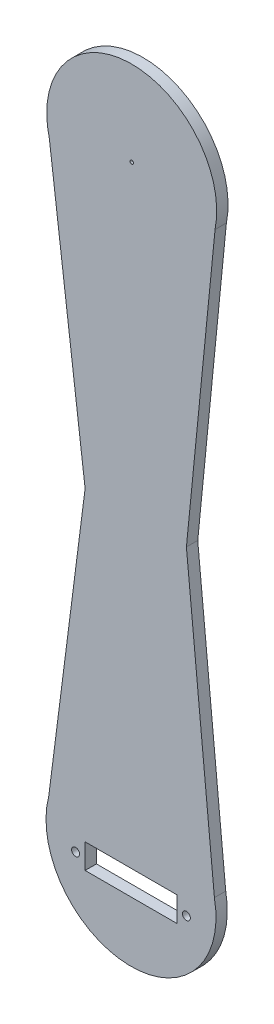
ISO-10303-21;
HEADER;
FILE_DESCRIPTION(('STEP AP214'),'2;1');
FILE_NAME('part.step','',(''),(''),'','','');
FILE_SCHEMA(('AUTOMOTIVE_DESIGN { 1 0 10303 214 1 1 1 1 }'));
ENDSEC;
DATA;
#1=APPLICATION_CONTEXT('core data for automotive mechanical design processes');
#2=APPLICATION_PROTOCOL_DEFINITION('international standard','automotive_design',2000,#1);
#3=PRODUCT_CONTEXT('',#1,'mechanical');
#4=PRODUCT('Part','Part','',(#3));
#5=PRODUCT_RELATED_PRODUCT_CATEGORY('part','',(#4));
#6=PRODUCT_DEFINITION_FORMATION('','',#4);
#7=PRODUCT_DEFINITION_CONTEXT('part definition',#1,'design');
#8=PRODUCT_DEFINITION('design','',#6,#7);
#9=PRODUCT_DEFINITION_SHAPE('','',#8);
#10=(LENGTH_UNIT() NAMED_UNIT(*) SI_UNIT(.MILLI.,.METRE.));
#11=(NAMED_UNIT(*) PLANE_ANGLE_UNIT() SI_UNIT($,.RADIAN.));
#12=(NAMED_UNIT(*) SI_UNIT($,.STERADIAN.) SOLID_ANGLE_UNIT());
#13=UNCERTAINTY_MEASURE_WITH_UNIT(LENGTH_MEASURE(1.E-05),#10,'distance_accuracy_value','');
#14=(GEOMETRIC_REPRESENTATION_CONTEXT(3) GLOBAL_UNCERTAINTY_ASSIGNED_CONTEXT((#13)) GLOBAL_UNIT_ASSIGNED_CONTEXT((#10,
#11,#12)) REPRESENTATION_CONTEXT('',''));
#15=CARTESIAN_POINT('',(0.,0.,0.));
#16=DIRECTION('',(0.,0.,1.));
#17=DIRECTION('',(1.,0.,0.));
#18=AXIS2_PLACEMENT_3D('',#15,#16,#17);
#19=CARTESIAN_POINT('',(0.323183532153549,270.,0.));
#20=DIRECTION('',(0.,0.,1.));
#21=DIRECTION('',(1.,0.,0.));
#22=AXIS2_PLACEMENT_3D('',#19,#20,#21);
#23=CYLINDRICAL_SURFACE('',#22,2.6);
#24=CARTESIAN_POINT('',(0.323183532153549,270.,0.));
#25=DIRECTION('',(0.,0.,1.));
#26=DIRECTION('',(1.,0.,0.));
#27=AXIS2_PLACEMENT_3D('',#24,#25,#26);
#28=CIRCLE('',#27,2.6);
#29=CARTESIAN_POINT('',(2.92318353215355,270.,0.));
#30=VERTEX_POINT('',#29);
#31=EDGE_CURVE('E365',#30,#30,#28,.T.);
#32=ORIENTED_EDGE('',*,*,#31,.F.);
#33=EDGE_LOOP('',(#32));
#34=FACE_BOUND('',#33,.T.);
#35=CARTESIAN_POINT('',(0.323183532153549,270.,4.));
#36=DIRECTION('',(0.,0.,1.));
#37=DIRECTION('',(1.,0.,0.));
#38=AXIS2_PLACEMENT_3D('',#35,#36,#37);
#39=CIRCLE('',#38,2.6);
#40=CARTESIAN_POINT('',(2.92318353215355,270.,4.));
#41=VERTEX_POINT('',#40);
#42=EDGE_CURVE('E12',#41,#41,#39,.F.);
#43=ORIENTED_EDGE('',*,*,#42,.F.);
#44=EDGE_LOOP('',(#43));
#45=FACE_BOUND('',#44,.T.);
#46=ADVANCED_FACE('F221',(#34,#45),#23,.F.);
#47=CARTESIAN_POINT('',(-37.5,0.,5.));
#48=DIRECTION('',(0.,1.,0.));
#49=DIRECTION('',(0.,0.,1.));
#50=AXIS2_PLACEMENT_3D('',#47,#48,#49);
#51=PLANE('',#50);
#52=DIRECTION('',(1.,0.,0.));
#53=VECTOR('',#52,1.);
#54=CARTESIAN_POINT('',(-37.5,0.,0.));
#55=LINE('',#54,#53);
#56=CARTESIAN_POINT('',(-20.25,0.,0.));
#57=VERTEX_POINT('',#56);
#58=CARTESIAN_POINT('',(20.25,0.,0.));
#59=VERTEX_POINT('',#58);
#60=EDGE_CURVE('E348',#57,#59,#55,.T.);
#61=ORIENTED_EDGE('',*,*,#60,.T.);
#62=DIRECTION('',(0.,0.,1.));
#63=VECTOR('',#62,1.);
#64=CARTESIAN_POINT('',(20.25,0.,5.));
#65=LINE('',#64,#63);
#66=CARTESIAN_POINT('',(20.25,0.,5.));
#67=VERTEX_POINT('',#66);
#68=EDGE_CURVE('E275',#59,#67,#65,.T.);
#69=ORIENTED_EDGE('',*,*,#68,.T.);
#70=DIRECTION('',(1.,0.,0.));
#71=VECTOR('',#70,1.);
#72=CARTESIAN_POINT('',(-37.5,0.,5.));
#73=LINE('',#72,#71);
#74=CARTESIAN_POINT('',(-20.25,0.,5.));
#75=VERTEX_POINT('',#74);
#76=EDGE_CURVE('E375',#75,#67,#73,.T.);
#77=ORIENTED_EDGE('',*,*,#76,.F.);
#78=DIRECTION('',(0.,0.,1.));
#79=VECTOR('',#78,1.);
#80=CARTESIAN_POINT('',(-20.25,0.,5.));
#81=LINE('',#80,#79);
#82=EDGE_CURVE('E297',#57,#75,#81,.T.);
#83=ORIENTED_EDGE('',*,*,#82,.F.);
#84=EDGE_LOOP('',(#61,#69,#77,#83));
#85=FACE_BOUND('',#84,.T.);
#86=ADVANCED_FACE('F414',(#85),#51,.F.);
#87=CARTESIAN_POINT('',(0.,0.,0.));
#88=DIRECTION('',(0.,0.,1.));
#89=DIRECTION('',(1.,0.,0.));
#90=AXIS2_PLACEMENT_3D('',#87,#88,#89);
#91=PLANE('',#90);
#92=ORIENTED_EDGE('',*,*,#31,.T.);
#93=EDGE_LOOP('',(#92));
#94=FACE_BOUND('',#93,.T.);
#95=DIRECTION('',(0.124409710318504,-0.992230932786549,0.));
#96=VECTOR('',#95,1.);
#97=CARTESIAN_POINT('',(-37.1768164678465,270.,0.));
#98=LINE('',#97,#96);
#99=CARTESIAN_POINT('',(-36.0159832662314,260.741762781223,0.));
#100=VERTEX_POINT('',#99);
#101=CARTESIAN_POINT('',(-20.25,135.,0.));
#102=VERTEX_POINT('',#101);
#103=EDGE_CURVE('E336',#100,#102,#98,.T.);
#104=ORIENTED_EDGE('',*,*,#103,.F.);
#105=CARTESIAN_POINT('',(0.323183532153548,270.,0.));
#106=DIRECTION('',(0.,0.,1.));
#107=DIRECTION('',(1.,0.,0.));
#108=AXIS2_PLACEMENT_3D('',#105,#106,#107);
#109=CIRCLE('',#108,37.5);
#110=CARTESIAN_POINT('',(37.094360017677,262.642651301556,0.));
#111=VERTEX_POINT('',#110);
#112=EDGE_CURVE('E294',#111,#100,#109,.T.);
#113=ORIENTED_EDGE('',*,*,#112,.F.);
#114=DIRECTION('',(0.0985781256653195,0.995129314782914,0.));
#115=VECTOR('',#114,1.);
#116=CARTESIAN_POINT('',(24.45,135.,0.));
#117=LINE('',#116,#115);
#118=CARTESIAN_POINT('',(24.45,135.,0.));
#119=VERTEX_POINT('',#118);
#120=EDGE_CURVE('E329',#119,#111,#117,.T.);
#121=ORIENTED_EDGE('',*,*,#120,.F.);
#122=DIRECTION('',(-0.0962181593708295,0.995360269353408,0.));
#123=VECTOR('',#122,1.);
#124=CARTESIAN_POINT('',(37.5,0.,0.));
#125=LINE('',#124,#123);
#126=CARTESIAN_POINT('',(36.8056549355467,7.1828799771028,0.));
#127=VERTEX_POINT('',#126);
#128=EDGE_CURVE('E350',#127,#119,#125,.T.);
#129=ORIENTED_EDGE('',*,*,#128,.F.);
#130=CARTESIAN_POINT('',(0.,0.,0.));
#131=DIRECTION('',(0.,0.,1.));
#132=DIRECTION('',(1.,0.,0.));
#133=AXIS2_PLACEMENT_3D('',#130,#131,#132);
#134=CIRCLE('',#133,37.5);
#135=CARTESIAN_POINT('',(-36.2951349873971,9.42937835950072,0.));
#136=VERTEX_POINT('',#135);
#137=EDGE_CURVE('E291',#136,#127,#134,.T.);
#138=ORIENTED_EDGE('',*,*,#137,.F.);
#139=DIRECTION('',(-0.126747255728497,-0.991935044831714,0.));
#140=VECTOR('',#139,1.);
#141=CARTESIAN_POINT('',(-20.25,135.,0.));
#142=LINE('',#141,#140);
#143=EDGE_CURVE('E339',#102,#136,#142,.T.);
#144=ORIENTED_EDGE('',*,*,#143,.F.);
#145=EDGE_LOOP('',(#104,#113,#121,#129,#138,#144));
#146=FACE_BOUND('',#145,.T.);
#147=ORIENTED_EDGE('',*,*,#60,.F.);
#148=DIRECTION('',(0.,1.,0.));
#149=VECTOR('',#148,1.);
#150=CARTESIAN_POINT('',(-20.25,-10.95,0.));
#151=LINE('',#150,#149);
#152=CARTESIAN_POINT('',(-20.25,-10.95,0.));
#153=VERTEX_POINT('',#152);
#154=EDGE_CURVE('E284',#153,#57,#151,.T.);
#155=ORIENTED_EDGE('',*,*,#154,.F.);
#156=DIRECTION('',(-1.,0.,0.));
#157=VECTOR('',#156,1.);
#158=CARTESIAN_POINT('',(20.25,-10.95,0.));
#159=LINE('',#158,#157);
#160=CARTESIAN_POINT('',(20.25,-10.95,0.));
#161=VERTEX_POINT('',#160);
#162=EDGE_CURVE('E260',#161,#153,#159,.T.);
#163=ORIENTED_EDGE('',*,*,#162,.F.);
#164=DIRECTION('',(0.,1.,0.));
#165=VECTOR('',#164,1.);
#166=CARTESIAN_POINT('',(20.25,-10.95,0.));
#167=LINE('',#166,#165);
#168=EDGE_CURVE('E272',#161,#59,#167,.T.);
#169=ORIENTED_EDGE('',*,*,#168,.T.);
#170=EDGE_LOOP('',(#147,#155,#163,#169));
#171=FACE_BOUND('',#170,.T.);
#172=CARTESIAN_POINT('',(-24.45,-5.95000000000001,0.));
#173=DIRECTION('',(0.,0.,1.));
#174=DIRECTION('',(1.,0.,0.));
#175=AXIS2_PLACEMENT_3D('',#172,#173,#174);
#176=CIRCLE('',#175,1.75);
#177=CARTESIAN_POINT('',(-22.7,-5.95000000000001,0.));
#178=VERTEX_POINT('',#177);
#179=EDGE_CURVE('E362',#178,#178,#176,.T.);
#180=ORIENTED_EDGE('',*,*,#179,.T.);
#181=EDGE_LOOP('',(#180));
#182=FACE_BOUND('',#181,.T.);
#183=CARTESIAN_POINT('',(24.45,-5.95,0.));
#184=DIRECTION('',(0.,0.,1.));
#185=DIRECTION('',(1.,0.,0.));
#186=AXIS2_PLACEMENT_3D('',#183,#184,#185);
#187=CIRCLE('',#186,1.75);
#188=CARTESIAN_POINT('',(26.2,-5.95,0.));
#189=VERTEX_POINT('',#188);
#190=EDGE_CURVE('E361',#189,#189,#187,.T.);
#191=ORIENTED_EDGE('',*,*,#190,.T.);
#192=EDGE_LOOP('',(#191));
#193=FACE_BOUND('',#192,.T.);
#194=ADVANCED_FACE('F281',(#94,#146,#171,#182,#193),#91,.F.);
#195=CARTESIAN_POINT('',(0.,0.,5.));
#196=DIRECTION('',(0.,0.,1.));
#197=DIRECTION('',(1.,0.,0.));
#198=AXIS2_PLACEMENT_3D('',#195,#196,#197);
#199=PLANE('',#198);
#200=CARTESIAN_POINT('',(0.323183532153549,270.,5.));
#201=DIRECTION('',(0.,0.,-1.));
#202=DIRECTION('',(-1.,0.,0.));
#203=AXIS2_PLACEMENT_3D('',#200,#201,#202);
#204=CIRCLE('',#203,0.750000000000243);
#205=CARTESIAN_POINT('',(-0.426816467846694,270.,5.));
#206=VERTEX_POINT('',#205);
#207=EDGE_CURVE('E392',#206,#206,#204,.T.);
#208=ORIENTED_EDGE('',*,*,#207,.T.);
#209=EDGE_LOOP('',(#208));
#210=FACE_BOUND('',#209,.T.);
#211=CARTESIAN_POINT('',(0.323183532153548,270.,5.));
#212=DIRECTION('',(0.,0.,1.));
#213=DIRECTION('',(1.,0.,0.));
#214=AXIS2_PLACEMENT_3D('',#211,#212,#213);
#215=CIRCLE('',#214,37.5);
#216=CARTESIAN_POINT('',(37.094360017677,262.642651301556,5.));
#217=VERTEX_POINT('',#216);
#218=CARTESIAN_POINT('',(-36.0159832662314,260.741762781223,5.));
#219=VERTEX_POINT('',#218);
#220=EDGE_CURVE('E320',#217,#219,#215,.T.);
#221=ORIENTED_EDGE('',*,*,#220,.T.);
#222=DIRECTION('',(0.124409710318504,-0.992230932786549,0.));
#223=VECTOR('',#222,1.);
#224=CARTESIAN_POINT('',(-37.1768164678465,270.,5.));
#225=LINE('',#224,#223);
#226=CARTESIAN_POINT('',(-20.25,135.,5.));
#227=VERTEX_POINT('',#226);
#228=EDGE_CURVE('E384',#219,#227,#225,.T.);
#229=ORIENTED_EDGE('',*,*,#228,.T.);
#230=DIRECTION('',(-0.126747255728497,-0.991935044831714,0.));
#231=VECTOR('',#230,1.);
#232=CARTESIAN_POINT('',(-20.25,135.,5.));
#233=LINE('',#232,#231);
#234=CARTESIAN_POINT('',(-36.2951349873971,9.42937835950072,5.));
#235=VERTEX_POINT('',#234);
#236=EDGE_CURVE('E381',#227,#235,#233,.T.);
#237=ORIENTED_EDGE('',*,*,#236,.T.);
#238=CARTESIAN_POINT('',(0.,0.,5.));
#239=DIRECTION('',(0.,0.,1.));
#240=DIRECTION('',(1.,0.,0.));
#241=AXIS2_PLACEMENT_3D('',#238,#239,#240);
#242=CIRCLE('',#241,37.5);
#243=CARTESIAN_POINT('',(36.8056549355467,7.1828799771028,5.));
#244=VERTEX_POINT('',#243);
#245=EDGE_CURVE('E292',#235,#244,#242,.T.);
#246=ORIENTED_EDGE('',*,*,#245,.T.);
#247=DIRECTION('',(-0.0962181593708295,0.995360269353408,0.));
#248=VECTOR('',#247,1.);
#249=CARTESIAN_POINT('',(37.5,0.,5.));
#250=LINE('',#249,#248);
#251=CARTESIAN_POINT('',(24.45,135.,5.));
#252=VERTEX_POINT('',#251);
#253=EDGE_CURVE('E343',#244,#252,#250,.T.);
#254=ORIENTED_EDGE('',*,*,#253,.T.);
#255=DIRECTION('',(0.0985781256653195,0.995129314782914,0.));
#256=VECTOR('',#255,1.);
#257=CARTESIAN_POINT('',(24.45,135.,5.));
#258=LINE('',#257,#256);
#259=EDGE_CURVE('E353',#252,#217,#258,.T.);
#260=ORIENTED_EDGE('',*,*,#259,.T.);
#261=EDGE_LOOP('',(#221,#229,#237,#246,#254,#260));
#262=FACE_BOUND('',#261,.T.);
#263=ORIENTED_EDGE('',*,*,#76,.T.);
#264=DIRECTION('',(0.,1.,0.));
#265=VECTOR('',#264,1.);
#266=CARTESIAN_POINT('',(20.25,-10.95,5.));
#267=LINE('',#266,#265);
#268=CARTESIAN_POINT('',(20.25,-10.95,5.));
#269=VERTEX_POINT('',#268);
#270=EDGE_CURVE('E268',#269,#67,#267,.T.);
#271=ORIENTED_EDGE('',*,*,#270,.F.);
#272=DIRECTION('',(-1.,0.,0.));
#273=VECTOR('',#272,1.);
#274=CARTESIAN_POINT('',(20.25,-10.95,5.));
#275=LINE('',#274,#273);
#276=CARTESIAN_POINT('',(-20.25,-10.95,5.));
#277=VERTEX_POINT('',#276);
#278=EDGE_CURVE('E263',#269,#277,#275,.T.);
#279=ORIENTED_EDGE('',*,*,#278,.T.);
#280=DIRECTION('',(0.,1.,0.));
#281=VECTOR('',#280,1.);
#282=CARTESIAN_POINT('',(-20.25,-10.95,5.));
#283=LINE('',#282,#281);
#284=EDGE_CURVE('E279',#277,#75,#283,.T.);
#285=ORIENTED_EDGE('',*,*,#284,.T.);
#286=EDGE_LOOP('',(#263,#271,#279,#285));
#287=FACE_BOUND('',#286,.T.);
#288=CARTESIAN_POINT('',(-24.45,-5.95000000000001,5.));
#289=DIRECTION('',(0.,0.,1.));
#290=DIRECTION('',(1.,0.,0.));
#291=AXIS2_PLACEMENT_3D('',#288,#289,#290);
#292=CIRCLE('',#291,1.75);
#293=CARTESIAN_POINT('',(-22.7,-5.95000000000001,5.));
#294=VERTEX_POINT('',#293);
#295=EDGE_CURVE('E358',#294,#294,#292,.T.);
#296=ORIENTED_EDGE('',*,*,#295,.F.);
#297=EDGE_LOOP('',(#296));
#298=FACE_BOUND('',#297,.T.);
#299=CARTESIAN_POINT('',(24.45,-5.95,5.));
#300=DIRECTION('',(0.,0.,1.));
#301=DIRECTION('',(1.,0.,0.));
#302=AXIS2_PLACEMENT_3D('',#299,#300,#301);
#303=CIRCLE('',#302,1.75);
#304=CARTESIAN_POINT('',(26.2,-5.95,5.));
#305=VERTEX_POINT('',#304);
#306=EDGE_CURVE('E286',#305,#305,#303,.T.);
#307=ORIENTED_EDGE('',*,*,#306,.F.);
#308=EDGE_LOOP('',(#307));
#309=FACE_BOUND('',#308,.T.);
#310=ADVANCED_FACE('F376',(#210,#262,#287,#298,#309),#199,.T.);
#311=CARTESIAN_POINT('',(-37.1768164678465,270.,5.));
#312=DIRECTION('',(0.992230932786549,0.124409710318504,0.));
#313=DIRECTION('',(-0.124409710318504,0.992230932786549,0.));
#314=AXIS2_PLACEMENT_3D('',#311,#312,#313);
#315=PLANE('',#314);
#316=DIRECTION('',(0.,0.,-1.));
#317=VECTOR('',#316,1.);
#318=CARTESIAN_POINT('',(-36.0159832662314,260.741762781223,5.));
#319=LINE('',#318,#317);
#320=EDGE_CURVE('E302',#100,#219,#319,.F.);
#321=ORIENTED_EDGE('',*,*,#320,.F.);
#322=ORIENTED_EDGE('',*,*,#103,.T.);
#323=DIRECTION('',(0.,0.,-1.));
#324=VECTOR('',#323,1.);
#325=CARTESIAN_POINT('',(-20.25,135.,5.));
#326=LINE('',#325,#324);
#327=EDGE_CURVE('E298',#227,#102,#326,.T.);
#328=ORIENTED_EDGE('',*,*,#327,.F.);
#329=ORIENTED_EDGE('',*,*,#228,.F.);
#330=EDGE_LOOP('',(#321,#322,#328,#329));
#331=FACE_BOUND('',#330,.T.);
#332=ADVANCED_FACE('F426',(#331),#315,.F.);
#333=CARTESIAN_POINT('',(-20.25,135.,5.));
#334=DIRECTION('',(0.991935044831714,-0.126747255728497,0.));
#335=DIRECTION('',(0.126747255728497,0.991935044831714,0.));
#336=AXIS2_PLACEMENT_3D('',#333,#334,#335);
#337=PLANE('',#336);
#338=DIRECTION('',(0.,0.,-1.));
#339=VECTOR('',#338,1.);
#340=CARTESIAN_POINT('',(-36.2951349873971,9.42937835950067,5.));
#341=LINE('',#340,#339);
#342=EDGE_CURVE('E299',#235,#136,#341,.T.);
#343=ORIENTED_EDGE('',*,*,#342,.F.);
#344=ORIENTED_EDGE('',*,*,#236,.F.);
#345=ORIENTED_EDGE('',*,*,#327,.T.);
#346=ORIENTED_EDGE('',*,*,#143,.T.);
#347=EDGE_LOOP('',(#343,#344,#345,#346));
#348=FACE_BOUND('',#347,.T.);
#349=ADVANCED_FACE('F431',(#348),#337,.F.);
#350=CARTESIAN_POINT('',(37.5,0.,5.));
#351=DIRECTION('',(-0.995360269353408,-0.0962181593708295,0.));
#352=DIRECTION('',(0.0962181593708295,-0.995360269353408,0.));
#353=AXIS2_PLACEMENT_3D('',#350,#351,#352);
#354=PLANE('',#353);
#355=DIRECTION('',(0.,0.,-1.));
#356=VECTOR('',#355,1.);
#357=CARTESIAN_POINT('',(36.8056549355467,7.18287997710289,5.));
#358=LINE('',#357,#356);
#359=EDGE_CURVE('E238',#127,#244,#358,.F.);
#360=ORIENTED_EDGE('',*,*,#359,.F.);
#361=ORIENTED_EDGE('',*,*,#128,.T.);
#362=DIRECTION('',(0.,0.,-1.));
#363=VECTOR('',#362,1.);
#364=CARTESIAN_POINT('',(24.45,135.,5.));
#365=LINE('',#364,#363);
#366=EDGE_CURVE('E333',#252,#119,#365,.T.);
#367=ORIENTED_EDGE('',*,*,#366,.F.);
#368=ORIENTED_EDGE('',*,*,#253,.F.);
#369=EDGE_LOOP('',(#360,#361,#367,#368));
#370=FACE_BOUND('',#369,.T.);
#371=ADVANCED_FACE('F429',(#370),#354,.F.);
#372=CARTESIAN_POINT('',(24.45,135.,5.));
#373=DIRECTION('',(-0.995129314782914,0.0985781256653195,0.));
#374=DIRECTION('',(-0.0985781256653195,-0.995129314782914,0.));
#375=AXIS2_PLACEMENT_3D('',#372,#373,#374);
#376=PLANE('',#375);
#377=DIRECTION('',(0.,0.,-1.));
#378=VECTOR('',#377,1.);
#379=CARTESIAN_POINT('',(37.094360017677,262.642651301557,5.));
#380=LINE('',#379,#378);
#381=EDGE_CURVE('E230',#217,#111,#380,.T.);
#382=ORIENTED_EDGE('',*,*,#381,.F.);
#383=ORIENTED_EDGE('',*,*,#259,.F.);
#384=ORIENTED_EDGE('',*,*,#366,.T.);
#385=ORIENTED_EDGE('',*,*,#120,.T.);
#386=EDGE_LOOP('',(#382,#383,#384,#385));
#387=FACE_BOUND('',#386,.T.);
#388=ADVANCED_FACE('F330',(#387),#376,.F.);
#389=CARTESIAN_POINT('',(0.,0.,5.));
#390=DIRECTION('',(0.,0.,-1.));
#391=DIRECTION('',(-1.,0.,0.));
#392=AXIS2_PLACEMENT_3D('',#389,#390,#391);
#393=CYLINDRICAL_SURFACE('',#392,37.5);
#394=ORIENTED_EDGE('',*,*,#245,.F.);
#395=ORIENTED_EDGE('',*,*,#342,.T.);
#396=ORIENTED_EDGE('',*,*,#137,.T.);
#397=ORIENTED_EDGE('',*,*,#359,.T.);
#398=EDGE_LOOP('',(#394,#395,#396,#397));
#399=FACE_BOUND('',#398,.T.);
#400=ADVANCED_FACE('F223',(#399),#393,.T.);
#401=CARTESIAN_POINT('',(20.25,-10.95,5.));
#402=DIRECTION('',(0.,-1.,0.));
#403=DIRECTION('',(1.,0.,0.));
#404=AXIS2_PLACEMENT_3D('',#401,#402,#403);
#405=PLANE('',#404);
#406=ORIENTED_EDGE('',*,*,#162,.T.);
#407=DIRECTION('',(0.,0.,-1.));
#408=VECTOR('',#407,1.);
#409=CARTESIAN_POINT('',(-20.25,-10.95,5.));
#410=LINE('',#409,#408);
#411=EDGE_CURVE('E267',#277,#153,#410,.T.);
#412=ORIENTED_EDGE('',*,*,#411,.F.);
#413=ORIENTED_EDGE('',*,*,#278,.F.);
#414=DIRECTION('',(0.,0.,-1.));
#415=VECTOR('',#414,1.);
#416=CARTESIAN_POINT('',(20.25,-10.95,5.));
#417=LINE('',#416,#415);
#418=EDGE_CURVE('E256',#269,#161,#417,.T.);
#419=ORIENTED_EDGE('',*,*,#418,.T.);
#420=EDGE_LOOP('',(#406,#412,#413,#419));
#421=FACE_BOUND('',#420,.T.);
#422=ADVANCED_FACE('F258',(#421),#405,.F.);
#423=CARTESIAN_POINT('',(-20.25,-10.95,5.));
#424=DIRECTION('',(-1.,0.,0.));
#425=DIRECTION('',(0.,0.,1.));
#426=AXIS2_PLACEMENT_3D('',#423,#424,#425);
#427=PLANE('',#426);
#428=ORIENTED_EDGE('',*,*,#154,.T.);
#429=ORIENTED_EDGE('',*,*,#82,.T.);
#430=ORIENTED_EDGE('',*,*,#284,.F.);
#431=ORIENTED_EDGE('',*,*,#411,.T.);
#432=EDGE_LOOP('',(#428,#429,#430,#431));
#433=FACE_BOUND('',#432,.T.);
#434=ADVANCED_FACE('F454',(#433),#427,.F.);
#435=CARTESIAN_POINT('',(20.25,-10.95,5.));
#436=DIRECTION('',(-1.,0.,0.));
#437=DIRECTION('',(0.,0.,1.));
#438=AXIS2_PLACEMENT_3D('',#435,#436,#437);
#439=PLANE('',#438);
#440=ORIENTED_EDGE('',*,*,#68,.F.);
#441=ORIENTED_EDGE('',*,*,#168,.F.);
#442=ORIENTED_EDGE('',*,*,#418,.F.);
#443=ORIENTED_EDGE('',*,*,#270,.T.);
#444=EDGE_LOOP('',(#440,#441,#442,#443));
#445=FACE_BOUND('',#444,.T.);
#446=ADVANCED_FACE('F273',(#445),#439,.T.);
#447=CARTESIAN_POINT('',(24.45,-5.95,5.));
#448=DIRECTION('',(0.,0.,-1.));
#449=DIRECTION('',(-1.,0.,0.));
#450=AXIS2_PLACEMENT_3D('',#447,#448,#449);
#451=CYLINDRICAL_SURFACE('',#450,1.75);
#452=ORIENTED_EDGE('',*,*,#306,.T.);
#453=EDGE_LOOP('',(#452));
#454=FACE_BOUND('',#453,.T.);
#455=ORIENTED_EDGE('',*,*,#190,.F.);
#456=EDGE_LOOP('',(#455));
#457=FACE_BOUND('',#456,.T.);
#458=ADVANCED_FACE('F447',(#454,#457),#451,.F.);
#459=CARTESIAN_POINT('',(-24.45,-5.95000000000001,5.));
#460=DIRECTION('',(0.,0.,-1.));
#461=DIRECTION('',(-1.,0.,0.));
#462=AXIS2_PLACEMENT_3D('',#459,#460,#461);
#463=CYLINDRICAL_SURFACE('',#462,1.75);
#464=ORIENTED_EDGE('',*,*,#295,.T.);
#465=EDGE_LOOP('',(#464));
#466=FACE_BOUND('',#465,.T.);
#467=ORIENTED_EDGE('',*,*,#179,.F.);
#468=EDGE_LOOP('',(#467));
#469=FACE_BOUND('',#468,.T.);
#470=ADVANCED_FACE('F444',(#466,#469),#463,.F.);
#471=CARTESIAN_POINT('',(0.323183532153548,270.,5.));
#472=DIRECTION('',(0.,0.,-1.));
#473=DIRECTION('',(-1.,0.,0.));
#474=AXIS2_PLACEMENT_3D('',#471,#472,#473);
#475=CYLINDRICAL_SURFACE('',#474,37.5);
#476=ORIENTED_EDGE('',*,*,#220,.F.);
#477=ORIENTED_EDGE('',*,*,#381,.T.);
#478=ORIENTED_EDGE('',*,*,#112,.T.);
#479=ORIENTED_EDGE('',*,*,#320,.T.);
#480=EDGE_LOOP('',(#476,#477,#478,#479));
#481=FACE_BOUND('',#480,.T.);
#482=ADVANCED_FACE('F314',(#481),#475,.T.);
#483=CARTESIAN_POINT('',(0.323183532153549,270.,4.));
#484=DIRECTION('',(0.,0.,1.));
#485=DIRECTION('',(1.,0.,0.));
#486=AXIS2_PLACEMENT_3D('',#483,#484,#485);
#487=PLANE('',#486);
#488=CARTESIAN_POINT('',(0.323183532153549,270.,4.));
#489=DIRECTION('',(0.,0.,-1.));
#490=DIRECTION('',(-1.,0.,0.));
#491=AXIS2_PLACEMENT_3D('',#488,#489,#490);
#492=CIRCLE('',#491,0.750000000000243);
#493=CARTESIAN_POINT('',(-0.426816467846694,270.,4.));
#494=VERTEX_POINT('',#493);
#495=EDGE_CURVE('E393',#494,#494,#492,.T.);
#496=ORIENTED_EDGE('',*,*,#495,.F.);
#497=EDGE_LOOP('',(#496));
#498=FACE_BOUND('',#497,.T.);
#499=ORIENTED_EDGE('',*,*,#42,.T.);
#500=EDGE_LOOP('',(#499));
#501=FACE_BOUND('',#500,.T.);
#502=ADVANCED_FACE('F404',(#498,#501),#487,.F.);
#503=CARTESIAN_POINT('',(0.323183532153549,270.,5.));
#504=DIRECTION('',(0.,0.,-1.));
#505=DIRECTION('',(-1.,0.,0.));
#506=AXIS2_PLACEMENT_3D('',#503,#504,#505);
#507=CYLINDRICAL_SURFACE('',#506,0.750000000000243);
#508=ORIENTED_EDGE('',*,*,#207,.F.);
#509=EDGE_LOOP('',(#508));
#510=FACE_BOUND('',#509,.T.);
#511=ORIENTED_EDGE('',*,*,#495,.T.);
#512=EDGE_LOOP('',(#511));
#513=FACE_BOUND('',#512,.T.);
#514=ADVANCED_FACE('F401',(#510,#513),#507,.F.);
#515=CLOSED_SHELL('',(#46,#86,#194,#310,#332,#349,#371,#388,#400,#422,#434,#446,#458,#470,#482,
#502,#514));
#516=MANIFOLD_SOLID_BREP('B2',#515);
#517=ADVANCED_BREP_SHAPE_REPRESENTATION('',(#18,#516),#14);
#518=SHAPE_DEFINITION_REPRESENTATION(#9,#517);
ENDSEC;
END-ISO-10303-21;
